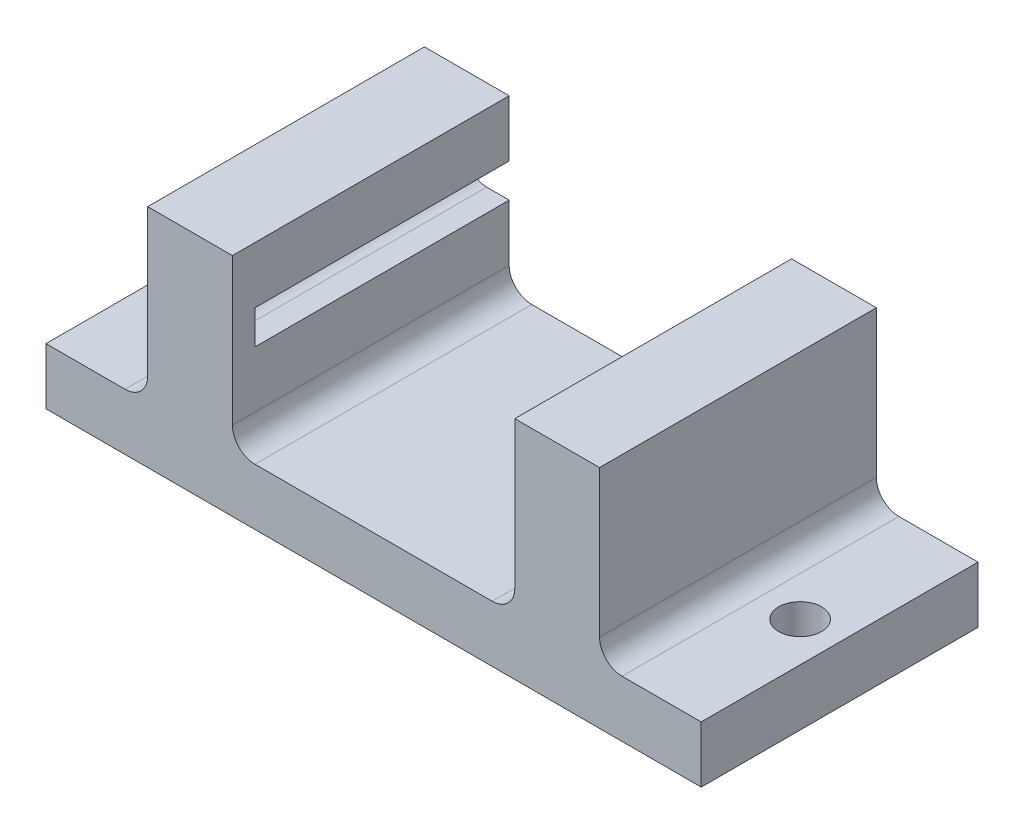
ISO-10303-21;
HEADER;
FILE_DESCRIPTION(('STEP AP214'),'2;1');
FILE_NAME('part.step','',(''),(''),'','','');
FILE_SCHEMA(('AUTOMOTIVE_DESIGN { 1 0 10303 214 1 1 1 1 }'));
ENDSEC;
DATA;
#1=APPLICATION_CONTEXT('core data for automotive mechanical design processes');
#2=APPLICATION_PROTOCOL_DEFINITION('international standard','automotive_design',2000,#1);
#3=PRODUCT_CONTEXT('',#1,'mechanical');
#4=PRODUCT('Part','Part','',(#3));
#5=PRODUCT_RELATED_PRODUCT_CATEGORY('part','',(#4));
#6=PRODUCT_DEFINITION_FORMATION('','',#4);
#7=PRODUCT_DEFINITION_CONTEXT('part definition',#1,'design');
#8=PRODUCT_DEFINITION('design','',#6,#7);
#9=PRODUCT_DEFINITION_SHAPE('','',#8);
#10=(LENGTH_UNIT() NAMED_UNIT(*) SI_UNIT(.MILLI.,.METRE.));
#11=(NAMED_UNIT(*) PLANE_ANGLE_UNIT() SI_UNIT($,.RADIAN.));
#12=(NAMED_UNIT(*) SI_UNIT($,.STERADIAN.) SOLID_ANGLE_UNIT());
#13=UNCERTAINTY_MEASURE_WITH_UNIT(LENGTH_MEASURE(1.E-05),#10,'distance_accuracy_value','');
#14=(GEOMETRIC_REPRESENTATION_CONTEXT(3) GLOBAL_UNCERTAINTY_ASSIGNED_CONTEXT((#13)) GLOBAL_UNIT_ASSIGNED_CONTEXT((#10,
#11,#12)) REPRESENTATION_CONTEXT('',''));
#15=CARTESIAN_POINT('',(0.,0.,0.));
#16=DIRECTION('',(0.,0.,1.));
#17=DIRECTION('',(1.,0.,0.));
#18=AXIS2_PLACEMENT_3D('',#15,#16,#17);
#19=CARTESIAN_POINT('',(0.,-25.4,28.575));
#20=DIRECTION('',(0.,1.,0.));
#21=DIRECTION('',(0.,0.,1.));
#22=AXIS2_PLACEMENT_3D('',#19,#20,#21);
#23=PLANE('',#22);
#24=CARTESIAN_POINT('',(-32.385,-25.4,15.5575));
#25=DIRECTION('',(0.,-1.,0.));
#26=DIRECTION('',(0.,0.,1.));
#27=AXIS2_PLACEMENT_3D('',#24,#25,#26);
#28=CIRCLE('',#27,2.41299999999999);
#29=CARTESIAN_POINT('',(-32.385,-25.4,17.9705));
#30=VERTEX_POINT('',#29);
#31=EDGE_CURVE('E236',#30,#30,#28,.T.);
#32=ORIENTED_EDGE('',*,*,#31,.F.);
#33=EDGE_LOOP('',(#32));
#34=FACE_BOUND('',#33,.T.);
#35=CARTESIAN_POINT('',(32.385,-25.4,15.5575));
#36=DIRECTION('',(0.,1.,0.));
#37=DIRECTION('',(0.,0.,1.));
#38=AXIS2_PLACEMENT_3D('',#35,#36,#37);
#39=CIRCLE('',#38,2.41299999999999);
#40=CARTESIAN_POINT('',(32.385,-25.4,17.9705));
#41=VERTEX_POINT('',#40);
#42=EDGE_CURVE('E319',#41,#41,#39,.T.);
#43=ORIENTED_EDGE('',*,*,#42,.T.);
#44=EDGE_LOOP('',(#43));
#45=FACE_BOUND('',#44,.T.);
#46=DIRECTION('',(1.,0.,0.));
#47=VECTOR('',#46,1.);
#48=CARTESIAN_POINT('',(0.,-25.4,0.));
#49=LINE('',#48,#47);
#50=CARTESIAN_POINT('',(-36.83,-25.4,0.));
#51=VERTEX_POINT('',#50);
#52=CARTESIAN_POINT('',(36.83,-25.4,0.));
#53=VERTEX_POINT('',#52);
#54=EDGE_CURVE('E217',#51,#53,#49,.T.);
#55=ORIENTED_EDGE('',*,*,#54,.T.);
#56=DIRECTION('',(0.,0.,-1.));
#57=VECTOR('',#56,1.);
#58=CARTESIAN_POINT('',(36.83,-25.4,28.575));
#59=LINE('',#58,#57);
#60=CARTESIAN_POINT('',(36.83,-25.4,31.115));
#61=VERTEX_POINT('',#60);
#62=EDGE_CURVE('E11',#61,#53,#59,.T.);
#63=ORIENTED_EDGE('',*,*,#62,.F.);
#64=DIRECTION('',(1.,0.,0.));
#65=VECTOR('',#64,1.);
#66=CARTESIAN_POINT('',(0.,-25.4,31.115));
#67=LINE('',#66,#65);
#68=CARTESIAN_POINT('',(-36.83,-25.4,31.115));
#69=VERTEX_POINT('',#68);
#70=EDGE_CURVE('E325',#69,#61,#67,.T.);
#71=ORIENTED_EDGE('',*,*,#70,.F.);
#72=DIRECTION('',(0.,0.,-1.));
#73=VECTOR('',#72,1.);
#74=CARTESIAN_POINT('',(-36.83,-25.4,28.575));
#75=LINE('',#74,#73);
#76=EDGE_CURVE('E267',#69,#51,#75,.T.);
#77=ORIENTED_EDGE('',*,*,#76,.T.);
#78=EDGE_LOOP('',(#55,#63,#71,#77));
#79=FACE_BOUND('',#78,.T.);
#80=ADVANCED_FACE('F33',(#34,#45,#79),#23,.F.);
#81=CARTESIAN_POINT('',(36.83,-25.4,28.575));
#82=DIRECTION('',(-1.,0.,0.));
#83=DIRECTION('',(0.,0.,1.));
#84=AXIS2_PLACEMENT_3D('',#81,#82,#83);
#85=PLANE('',#84);
#86=DIRECTION('',(0.,1.,0.));
#87=VECTOR('',#86,1.);
#88=CARTESIAN_POINT('',(36.83,-25.4,0.));
#89=LINE('',#88,#87);
#90=CARTESIAN_POINT('',(36.83,-19.05,0.));
#91=VERTEX_POINT('',#90);
#92=EDGE_CURVE('E416',#53,#91,#89,.T.);
#93=ORIENTED_EDGE('',*,*,#92,.T.);
#94=DIRECTION('',(0.,0.,-1.));
#95=VECTOR('',#94,1.);
#96=CARTESIAN_POINT('',(36.83,-19.05,28.575));
#97=LINE('',#96,#95);
#98=CARTESIAN_POINT('',(36.83,-19.05,31.115));
#99=VERTEX_POINT('',#98);
#100=EDGE_CURVE('E42',#99,#91,#97,.T.);
#101=ORIENTED_EDGE('',*,*,#100,.F.);
#102=DIRECTION('',(0.,1.,0.));
#103=VECTOR('',#102,1.);
#104=CARTESIAN_POINT('',(36.83,-25.4,31.115));
#105=LINE('',#104,#103);
#106=EDGE_CURVE('E328',#61,#99,#105,.T.);
#107=ORIENTED_EDGE('',*,*,#106,.F.);
#108=ORIENTED_EDGE('',*,*,#62,.T.);
#109=EDGE_LOOP('',(#93,#101,#107,#108));
#110=FACE_BOUND('',#109,.T.);
#111=ADVANCED_FACE('F423',(#110),#85,.F.);
#112=CARTESIAN_POINT('',(36.83,-19.05,28.575));
#113=DIRECTION('',(0.,-1.,0.));
#114=DIRECTION('',(0.,0.,-1.));
#115=AXIS2_PLACEMENT_3D('',#112,#113,#114);
#116=PLANE('',#115);
#117=CARTESIAN_POINT('',(32.385,-19.05,15.5575));
#118=DIRECTION('',(0.,1.,0.));
#119=DIRECTION('',(0.,0.,1.));
#120=AXIS2_PLACEMENT_3D('',#117,#118,#119);
#121=CIRCLE('',#120,2.41299999999999);
#122=CARTESIAN_POINT('',(32.385,-19.05,17.9705));
#123=VERTEX_POINT('',#122);
#124=EDGE_CURVE('E227',#123,#123,#121,.T.);
#125=ORIENTED_EDGE('',*,*,#124,.F.);
#126=EDGE_LOOP('',(#125));
#127=FACE_BOUND('',#126,.T.);
#128=DIRECTION('',(-1.,0.,0.));
#129=VECTOR('',#128,1.);
#130=CARTESIAN_POINT('',(36.83,-19.05,0.));
#131=LINE('',#130,#129);
#132=CARTESIAN_POINT('',(27.94,-19.05,0.));
#133=VERTEX_POINT('',#132);
#134=EDGE_CURVE('E415',#91,#133,#131,.T.);
#135=ORIENTED_EDGE('',*,*,#134,.T.);
#136=DIRECTION('',(0.,0.,-1.));
#137=VECTOR('',#136,1.);
#138=CARTESIAN_POINT('',(27.94,-19.05,28.575));
#139=LINE('',#138,#137);
#140=CARTESIAN_POINT('',(27.94,-19.05,31.115));
#141=VERTEX_POINT('',#140);
#142=EDGE_CURVE('E390',#141,#133,#139,.T.);
#143=ORIENTED_EDGE('',*,*,#142,.F.);
#144=DIRECTION('',(-1.,0.,0.));
#145=VECTOR('',#144,1.);
#146=CARTESIAN_POINT('',(36.83,-19.05,31.115));
#147=LINE('',#146,#145);
#148=EDGE_CURVE('E331',#99,#141,#147,.T.);
#149=ORIENTED_EDGE('',*,*,#148,.F.);
#150=ORIENTED_EDGE('',*,*,#100,.T.);
#151=EDGE_LOOP('',(#135,#143,#149,#150));
#152=FACE_BOUND('',#151,.T.);
#153=ADVANCED_FACE('F428',(#127,#152),#116,.F.);
#154=CARTESIAN_POINT('',(27.94,-16.51,28.575));
#155=DIRECTION('',(0.,0.,-1.));
#156=DIRECTION('',(-1.,0.,0.));
#157=AXIS2_PLACEMENT_3D('',#154,#155,#156);
#158=CYLINDRICAL_SURFACE('',#157,2.54);
#159=CARTESIAN_POINT('',(27.94,-16.51,0.));
#160=DIRECTION('',(0.,0.,-1.));
#161=DIRECTION('',(1.,0.,0.));
#162=AXIS2_PLACEMENT_3D('',#159,#160,#161);
#163=CIRCLE('',#162,2.54);
#164=CARTESIAN_POINT('',(25.4,-16.51,0.));
#165=VERTEX_POINT('',#164);
#166=EDGE_CURVE('E413',#133,#165,#163,.T.);
#167=ORIENTED_EDGE('',*,*,#166,.T.);
#168=DIRECTION('',(0.,0.,-1.));
#169=VECTOR('',#168,1.);
#170=CARTESIAN_POINT('',(25.4,-16.51,28.575));
#171=LINE('',#170,#169);
#172=CARTESIAN_POINT('',(25.4,-16.51,31.115));
#173=VERTEX_POINT('',#172);
#174=EDGE_CURVE('E387',#173,#165,#171,.T.);
#175=ORIENTED_EDGE('',*,*,#174,.F.);
#176=CARTESIAN_POINT('',(27.94,-16.51,31.115));
#177=DIRECTION('',(0.,0.,-1.));
#178=DIRECTION('',(1.,0.,0.));
#179=AXIS2_PLACEMENT_3D('',#176,#177,#178);
#180=CIRCLE('',#179,2.54);
#181=EDGE_CURVE('E334',#141,#173,#180,.T.);
#182=ORIENTED_EDGE('',*,*,#181,.F.);
#183=ORIENTED_EDGE('',*,*,#142,.T.);
#184=EDGE_LOOP('',(#167,#175,#182,#183));
#185=FACE_BOUND('',#184,.T.);
#186=ADVANCED_FACE('F432',(#185),#158,.F.);
#187=CARTESIAN_POINT('',(25.4,-16.51,28.575));
#188=DIRECTION('',(-1.,0.,0.));
#189=DIRECTION('',(0.,-1.,0.));
#190=AXIS2_PLACEMENT_3D('',#187,#188,#189);
#191=PLANE('',#190);
#192=DIRECTION('',(0.,1.,0.));
#193=VECTOR('',#192,1.);
#194=CARTESIAN_POINT('',(25.4,-16.51,0.));
#195=LINE('',#194,#193);
#196=CARTESIAN_POINT('',(25.4,0.,0.));
#197=VERTEX_POINT('',#196);
#198=EDGE_CURVE('E411',#165,#197,#195,.T.);
#199=ORIENTED_EDGE('',*,*,#198,.T.);
#200=DIRECTION('',(0.,0.,-1.));
#201=VECTOR('',#200,1.);
#202=CARTESIAN_POINT('',(25.4,0.,28.575));
#203=LINE('',#202,#201);
#204=CARTESIAN_POINT('',(25.4,0.,31.115));
#205=VERTEX_POINT('',#204);
#206=EDGE_CURVE('E384',#205,#197,#203,.T.);
#207=ORIENTED_EDGE('',*,*,#206,.F.);
#208=DIRECTION('',(0.,1.,0.));
#209=VECTOR('',#208,1.);
#210=CARTESIAN_POINT('',(25.4,-16.51,31.115));
#211=LINE('',#210,#209);
#212=EDGE_CURVE('E337',#173,#205,#211,.T.);
#213=ORIENTED_EDGE('',*,*,#212,.F.);
#214=ORIENTED_EDGE('',*,*,#174,.T.);
#215=EDGE_LOOP('',(#199,#207,#213,#214));
#216=FACE_BOUND('',#215,.T.);
#217=ADVANCED_FACE('F436',(#216),#191,.F.);
#218=CARTESIAN_POINT('',(25.4,0.,28.575));
#219=DIRECTION('',(0.,-1.,0.));
#220=DIRECTION('',(1.,0.,0.));
#221=AXIS2_PLACEMENT_3D('',#218,#219,#220);
#222=PLANE('',#221);
#223=DIRECTION('',(-1.,0.,0.));
#224=VECTOR('',#223,1.);
#225=CARTESIAN_POINT('',(25.4,0.,0.));
#226=LINE('',#225,#224);
#227=CARTESIAN_POINT('',(15.875,0.,0.));
#228=VERTEX_POINT('',#227);
#229=EDGE_CURVE('E409',#197,#228,#226,.T.);
#230=ORIENTED_EDGE('',*,*,#229,.T.);
#231=DIRECTION('',(0.,0.,-1.));
#232=VECTOR('',#231,1.);
#233=CARTESIAN_POINT('',(15.875,0.,28.575));
#234=LINE('',#233,#232);
#235=CARTESIAN_POINT('',(15.875,0.,31.115));
#236=VERTEX_POINT('',#235);
#237=EDGE_CURVE('E365',#236,#228,#234,.T.);
#238=ORIENTED_EDGE('',*,*,#237,.F.);
#239=DIRECTION('',(-1.,0.,0.));
#240=VECTOR('',#239,1.);
#241=CARTESIAN_POINT('',(25.4,0.,31.115));
#242=LINE('',#241,#240);
#243=EDGE_CURVE('E340',#205,#236,#242,.T.);
#244=ORIENTED_EDGE('',*,*,#243,.F.);
#245=ORIENTED_EDGE('',*,*,#206,.T.);
#246=EDGE_LOOP('',(#230,#238,#244,#245));
#247=FACE_BOUND('',#246,.T.);
#248=ADVANCED_FACE('F439',(#247),#222,.F.);
#249=CARTESIAN_POINT('',(15.875,-6.35,28.575));
#250=DIRECTION('',(0.,1.,0.));
#251=DIRECTION('',(-1.,0.,0.));
#252=AXIS2_PLACEMENT_3D('',#249,#250,#251);
#253=PLANE('',#252);
#254=DIRECTION('',(1.,0.,0.));
#255=VECTOR('',#254,1.);
#256=CARTESIAN_POINT('',(15.875,-6.35,0.));
#257=LINE('',#256,#255);
#258=CARTESIAN_POINT('',(15.875,-6.35,0.));
#259=VERTEX_POINT('',#258);
#260=CARTESIAN_POINT('',(18.415,-6.35,0.));
#261=VERTEX_POINT('',#260);
#262=EDGE_CURVE('E405',#259,#261,#257,.T.);
#263=ORIENTED_EDGE('',*,*,#262,.T.);
#264=DIRECTION('',(0.,0.,-1.));
#265=VECTOR('',#264,1.);
#266=CARTESIAN_POINT('',(18.415,-6.35,28.575));
#267=LINE('',#266,#265);
#268=CARTESIAN_POINT('',(18.415,-6.35,28.575));
#269=VERTEX_POINT('',#268);
#270=EDGE_CURVE('E366',#269,#261,#267,.T.);
#271=ORIENTED_EDGE('',*,*,#270,.F.);
#272=DIRECTION('',(1.,0.,0.));
#273=VECTOR('',#272,1.);
#274=CARTESIAN_POINT('',(15.875,-6.35,28.575));
#275=LINE('',#274,#273);
#276=CARTESIAN_POINT('',(15.875,-6.35,28.575));
#277=VERTEX_POINT('',#276);
#278=EDGE_CURVE('E353',#277,#269,#275,.T.);
#279=ORIENTED_EDGE('',*,*,#278,.F.);
#280=DIRECTION('',(0.,0.,-1.));
#281=VECTOR('',#280,1.);
#282=CARTESIAN_POINT('',(15.875,-6.35,28.575));
#283=LINE('',#282,#281);
#284=EDGE_CURVE('E104',#277,#259,#283,.T.);
#285=ORIENTED_EDGE('',*,*,#284,.T.);
#286=EDGE_LOOP('',(#263,#271,#279,#285));
#287=FACE_BOUND('',#286,.T.);
#288=ADVANCED_FACE('F444',(#287),#253,.F.);
#289=CARTESIAN_POINT('',(18.415,-8.255,28.575));
#290=DIRECTION('',(0.,0.,-1.));
#291=DIRECTION('',(-1.,0.,0.));
#292=AXIS2_PLACEMENT_3D('',#289,#290,#291);
#293=CYLINDRICAL_SURFACE('',#292,1.905);
#294=CARTESIAN_POINT('',(18.415,-8.255,0.));
#295=DIRECTION('',(0.,0.,-1.));
#296=DIRECTION('',(1.,0.,0.));
#297=AXIS2_PLACEMENT_3D('',#294,#295,#296);
#298=CIRCLE('',#297,1.905);
#299=CARTESIAN_POINT('',(18.415,-10.16,0.));
#300=VERTEX_POINT('',#299);
#301=EDGE_CURVE('E401',#261,#300,#298,.T.);
#302=ORIENTED_EDGE('',*,*,#301,.T.);
#303=DIRECTION('',(0.,0.,-1.));
#304=VECTOR('',#303,1.);
#305=CARTESIAN_POINT('',(18.415,-10.16,28.575));
#306=LINE('',#305,#304);
#307=CARTESIAN_POINT('',(18.415,-10.16,28.575));
#308=VERTEX_POINT('',#307);
#309=EDGE_CURVE('E51',#308,#300,#306,.T.);
#310=ORIENTED_EDGE('',*,*,#309,.F.);
#311=CARTESIAN_POINT('',(18.415,-8.255,28.575));
#312=DIRECTION('',(0.,0.,-1.));
#313=DIRECTION('',(1.,0.,0.));
#314=AXIS2_PLACEMENT_3D('',#311,#312,#313);
#315=CIRCLE('',#314,1.905);
#316=EDGE_CURVE('E349',#269,#308,#315,.T.);
#317=ORIENTED_EDGE('',*,*,#316,.F.);
#318=ORIENTED_EDGE('',*,*,#270,.T.);
#319=EDGE_LOOP('',(#302,#310,#317,#318));
#320=FACE_BOUND('',#319,.T.);
#321=ADVANCED_FACE('F448',(#320),#293,.F.);
#322=CARTESIAN_POINT('',(15.875,-10.16,28.575));
#323=DIRECTION('',(0.,-1.,0.));
#324=DIRECTION('',(1.,0.,0.));
#325=AXIS2_PLACEMENT_3D('',#322,#323,#324);
#326=PLANE('',#325);
#327=DIRECTION('',(-1.,0.,0.));
#328=VECTOR('',#327,1.);
#329=CARTESIAN_POINT('',(15.875,-10.16,0.));
#330=LINE('',#329,#328);
#331=CARTESIAN_POINT('',(15.875,-10.16,0.));
#332=VERTEX_POINT('',#331);
#333=EDGE_CURVE('E400',#300,#332,#330,.T.);
#334=ORIENTED_EDGE('',*,*,#333,.T.);
#335=DIRECTION('',(0.,0.,-1.));
#336=VECTOR('',#335,1.);
#337=CARTESIAN_POINT('',(15.875,-10.16,28.575));
#338=LINE('',#337,#336);
#339=CARTESIAN_POINT('',(15.875,-10.16,28.575));
#340=VERTEX_POINT('',#339);
#341=EDGE_CURVE('E378',#340,#332,#338,.T.);
#342=ORIENTED_EDGE('',*,*,#341,.F.);
#343=DIRECTION('',(-1.,0.,0.));
#344=VECTOR('',#343,1.);
#345=CARTESIAN_POINT('',(15.875,-10.16,28.575));
#346=LINE('',#345,#344);
#347=EDGE_CURVE('E352',#308,#340,#346,.T.);
#348=ORIENTED_EDGE('',*,*,#347,.F.);
#349=ORIENTED_EDGE('',*,*,#309,.T.);
#350=EDGE_LOOP('',(#334,#342,#348,#349));
#351=FACE_BOUND('',#350,.T.);
#352=ADVANCED_FACE('F446',(#351),#326,.F.);
#353=CARTESIAN_POINT('',(15.875,-16.51,28.575));
#354=DIRECTION('',(1.,0.,0.));
#355=DIRECTION('',(0.,1.,0.));
#356=AXIS2_PLACEMENT_3D('',#353,#354,#355);
#357=PLANE('',#356);
#358=DIRECTION('',(0.,-1.,0.));
#359=VECTOR('',#358,1.);
#360=CARTESIAN_POINT('',(15.875,-16.51,0.));
#361=LINE('',#360,#359);
#362=CARTESIAN_POINT('',(15.875,-16.51,0.));
#363=VERTEX_POINT('',#362);
#364=EDGE_CURVE('E93',#332,#363,#361,.T.);
#365=ORIENTED_EDGE('',*,*,#364,.T.);
#366=DIRECTION('',(0.,0.,-1.));
#367=VECTOR('',#366,1.);
#368=CARTESIAN_POINT('',(15.875,-16.51,28.575));
#369=LINE('',#368,#367);
#370=CARTESIAN_POINT('',(15.875,-16.51,31.115));
#371=VERTEX_POINT('',#370);
#372=EDGE_CURVE('E376',#371,#363,#369,.T.);
#373=ORIENTED_EDGE('',*,*,#372,.F.);
#374=DIRECTION('',(0.,-1.,0.));
#375=VECTOR('',#374,1.);
#376=CARTESIAN_POINT('',(15.875,0.,31.115));
#377=LINE('',#376,#375);
#378=EDGE_CURVE('E343',#236,#371,#377,.T.);
#379=ORIENTED_EDGE('',*,*,#378,.F.);
#380=ORIENTED_EDGE('',*,*,#237,.T.);
#381=DIRECTION('',(0.,-1.,0.));
#382=VECTOR('',#381,1.);
#383=CARTESIAN_POINT('',(15.875,0.,0.));
#384=LINE('',#383,#382);
#385=EDGE_CURVE('E407',#228,#259,#384,.T.);
#386=ORIENTED_EDGE('',*,*,#385,.T.);
#387=ORIENTED_EDGE('',*,*,#284,.F.);
#388=DIRECTION('',(0.,-1.,0.));
#389=VECTOR('',#388,1.);
#390=CARTESIAN_POINT('',(15.875,-10.16,28.575));
#391=LINE('',#390,#389);
#392=EDGE_CURVE('E322',#277,#340,#391,.T.);
#393=ORIENTED_EDGE('',*,*,#392,.T.);
#394=ORIENTED_EDGE('',*,*,#341,.T.);
#395=EDGE_LOOP('',(#365,#373,#379,#380,#386,#387,#393,#394));
#396=FACE_BOUND('',#395,.T.);
#397=ADVANCED_FACE('F394',(#396),#357,.F.);
#398=CARTESIAN_POINT('',(13.335,-16.51,28.575));
#399=DIRECTION('',(0.,0.,-1.));
#400=DIRECTION('',(-1.,0.,0.));
#401=AXIS2_PLACEMENT_3D('',#398,#399,#400);
#402=CYLINDRICAL_SURFACE('',#401,2.54);
#403=CARTESIAN_POINT('',(13.335,-16.51,0.));
#404=DIRECTION('',(0.,0.,-1.));
#405=DIRECTION('',(1.,0.,0.));
#406=AXIS2_PLACEMENT_3D('',#403,#404,#405);
#407=CIRCLE('',#406,2.54);
#408=CARTESIAN_POINT('',(13.335,-19.05,0.));
#409=VERTEX_POINT('',#408);
#410=EDGE_CURVE('E99',#363,#409,#407,.T.);
#411=ORIENTED_EDGE('',*,*,#410,.T.);
#412=DIRECTION('',(0.,0.,-1.));
#413=VECTOR('',#412,1.);
#414=CARTESIAN_POINT('',(13.335,-19.05,28.575));
#415=LINE('',#414,#413);
#416=CARTESIAN_POINT('',(13.335,-19.05,31.115));
#417=VERTEX_POINT('',#416);
#418=EDGE_CURVE('E361',#417,#409,#415,.T.);
#419=ORIENTED_EDGE('',*,*,#418,.F.);
#420=CARTESIAN_POINT('',(13.335,-16.51,31.115));
#421=DIRECTION('',(0.,0.,-1.));
#422=DIRECTION('',(1.,0.,0.));
#423=AXIS2_PLACEMENT_3D('',#420,#421,#422);
#424=CIRCLE('',#423,2.54);
#425=EDGE_CURVE('E215',#371,#417,#424,.T.);
#426=ORIENTED_EDGE('',*,*,#425,.F.);
#427=ORIENTED_EDGE('',*,*,#372,.T.);
#428=EDGE_LOOP('',(#411,#419,#426,#427));
#429=FACE_BOUND('',#428,.T.);
#430=ADVANCED_FACE('F454',(#429),#402,.F.);
#431=CARTESIAN_POINT('',(13.335,-19.05,28.575));
#432=DIRECTION('',(0.,-1.,0.));
#433=DIRECTION('',(1.,0.,0.));
#434=AXIS2_PLACEMENT_3D('',#431,#432,#433);
#435=PLANE('',#434);
#436=DIRECTION('',(-1.,0.,0.));
#437=VECTOR('',#436,1.);
#438=CARTESIAN_POINT('',(13.335,-19.05,0.));
#439=LINE('',#438,#437);
#440=CARTESIAN_POINT('',(-13.335,-19.05,0.));
#441=VERTEX_POINT('',#440);
#442=EDGE_CURVE('E223',#409,#441,#439,.T.);
#443=ORIENTED_EDGE('',*,*,#442,.T.);
#444=DIRECTION('',(0.,0.,-1.));
#445=VECTOR('',#444,1.);
#446=CARTESIAN_POINT('',(-13.335,-19.05,28.575));
#447=LINE('',#446,#445);
#448=CARTESIAN_POINT('',(-13.335,-19.05,31.115));
#449=VERTEX_POINT('',#448);
#450=EDGE_CURVE('E220',#449,#441,#447,.T.);
#451=ORIENTED_EDGE('',*,*,#450,.F.);
#452=DIRECTION('',(-1.,0.,0.));
#453=VECTOR('',#452,1.);
#454=CARTESIAN_POINT('',(13.335,-19.05,31.115));
#455=LINE('',#454,#453);
#456=EDGE_CURVE('E206',#417,#449,#455,.T.);
#457=ORIENTED_EDGE('',*,*,#456,.F.);
#458=ORIENTED_EDGE('',*,*,#418,.T.);
#459=EDGE_LOOP('',(#443,#451,#457,#458));
#460=FACE_BOUND('',#459,.T.);
#461=ADVANCED_FACE('F221',(#460),#435,.F.);
#462=CARTESIAN_POINT('',(27.94,-16.51,0.));
#463=DIRECTION('',(0.,0.,1.));
#464=DIRECTION('',(1.,0.,0.));
#465=AXIS2_PLACEMENT_3D('',#462,#463,#464);
#466=PLANE('',#465);
#467=ORIENTED_EDGE('',*,*,#54,.F.);
#468=DIRECTION('',(0.,1.,0.));
#469=VECTOR('',#468,1.);
#470=CARTESIAN_POINT('',(-36.83,-25.4,0.));
#471=LINE('',#470,#469);
#472=CARTESIAN_POINT('',(-36.83,-19.05,0.));
#473=VERTEX_POINT('',#472);
#474=EDGE_CURVE('E261',#51,#473,#471,.T.);
#475=ORIENTED_EDGE('',*,*,#474,.T.);
#476=DIRECTION('',(1.,0.,0.));
#477=VECTOR('',#476,1.);
#478=CARTESIAN_POINT('',(-36.83,-19.05,0.));
#479=LINE('',#478,#477);
#480=CARTESIAN_POINT('',(-27.94,-19.05,0.));
#481=VERTEX_POINT('',#480);
#482=EDGE_CURVE('E293',#473,#481,#479,.T.);
#483=ORIENTED_EDGE('',*,*,#482,.T.);
#484=CARTESIAN_POINT('',(-27.94,-16.51,0.));
#485=DIRECTION('',(0.,0.,1.));
#486=DIRECTION('',(-1.,0.,0.));
#487=AXIS2_PLACEMENT_3D('',#484,#485,#486);
#488=CIRCLE('',#487,2.54);
#489=CARTESIAN_POINT('',(-25.4,-16.51,0.));
#490=VERTEX_POINT('',#489);
#491=EDGE_CURVE('E290',#481,#490,#488,.T.);
#492=ORIENTED_EDGE('',*,*,#491,.T.);
#493=DIRECTION('',(0.,1.,0.));
#494=VECTOR('',#493,1.);
#495=CARTESIAN_POINT('',(-25.4,-16.51,0.));
#496=LINE('',#495,#494);
#497=CARTESIAN_POINT('',(-25.4,0.,0.));
#498=VERTEX_POINT('',#497);
#499=EDGE_CURVE('E287',#490,#498,#496,.T.);
#500=ORIENTED_EDGE('',*,*,#499,.T.);
#501=DIRECTION('',(1.,0.,0.));
#502=VECTOR('',#501,1.);
#503=CARTESIAN_POINT('',(-25.4,0.,0.));
#504=LINE('',#503,#502);
#505=CARTESIAN_POINT('',(-15.875,0.,0.));
#506=VERTEX_POINT('',#505);
#507=EDGE_CURVE('E284',#498,#506,#504,.T.);
#508=ORIENTED_EDGE('',*,*,#507,.T.);
#509=DIRECTION('',(0.,-1.,0.));
#510=VECTOR('',#509,1.);
#511=CARTESIAN_POINT('',(-15.875,0.,0.));
#512=LINE('',#511,#510);
#513=CARTESIAN_POINT('',(-15.875,-6.35,0.));
#514=VERTEX_POINT('',#513);
#515=EDGE_CURVE('E281',#506,#514,#512,.T.);
#516=ORIENTED_EDGE('',*,*,#515,.T.);
#517=DIRECTION('',(-1.,0.,0.));
#518=VECTOR('',#517,1.);
#519=CARTESIAN_POINT('',(-15.875,-6.35,0.));
#520=LINE('',#519,#518);
#521=CARTESIAN_POINT('',(-18.415,-6.35,0.));
#522=VERTEX_POINT('',#521);
#523=EDGE_CURVE('E278',#514,#522,#520,.T.);
#524=ORIENTED_EDGE('',*,*,#523,.T.);
#525=CARTESIAN_POINT('',(-18.415,-8.255,0.));
#526=DIRECTION('',(0.,0.,1.));
#527=DIRECTION('',(-1.,0.,0.));
#528=AXIS2_PLACEMENT_3D('',#525,#526,#527);
#529=CIRCLE('',#528,1.905);
#530=CARTESIAN_POINT('',(-18.415,-10.16,0.));
#531=VERTEX_POINT('',#530);
#532=EDGE_CURVE('E275',#522,#531,#529,.T.);
#533=ORIENTED_EDGE('',*,*,#532,.T.);
#534=DIRECTION('',(1.,0.,0.));
#535=VECTOR('',#534,1.);
#536=CARTESIAN_POINT('',(-15.875,-10.16,0.));
#537=LINE('',#536,#535);
#538=CARTESIAN_POINT('',(-15.875,-10.16,0.));
#539=VERTEX_POINT('',#538);
#540=EDGE_CURVE('E272',#531,#539,#537,.T.);
#541=ORIENTED_EDGE('',*,*,#540,.T.);
#542=DIRECTION('',(0.,-1.,0.));
#543=VECTOR('',#542,1.);
#544=CARTESIAN_POINT('',(-15.875,-16.51,0.));
#545=LINE('',#544,#543);
#546=CARTESIAN_POINT('',(-15.875,-16.51,0.));
#547=VERTEX_POINT('',#546);
#548=EDGE_CURVE('E269',#539,#547,#545,.T.);
#549=ORIENTED_EDGE('',*,*,#548,.T.);
#550=CARTESIAN_POINT('',(-13.335,-16.51,0.));
#551=DIRECTION('',(0.,0.,1.));
#552=DIRECTION('',(-1.,0.,0.));
#553=AXIS2_PLACEMENT_3D('',#550,#551,#552);
#554=CIRCLE('',#553,2.54);
#555=EDGE_CURVE('E255',#547,#441,#554,.T.);
#556=ORIENTED_EDGE('',*,*,#555,.T.);
#557=ORIENTED_EDGE('',*,*,#442,.F.);
#558=ORIENTED_EDGE('',*,*,#410,.F.);
#559=ORIENTED_EDGE('',*,*,#364,.F.);
#560=ORIENTED_EDGE('',*,*,#333,.F.);
#561=ORIENTED_EDGE('',*,*,#301,.F.);
#562=ORIENTED_EDGE('',*,*,#262,.F.);
#563=ORIENTED_EDGE('',*,*,#385,.F.);
#564=ORIENTED_EDGE('',*,*,#229,.F.);
#565=ORIENTED_EDGE('',*,*,#198,.F.);
#566=ORIENTED_EDGE('',*,*,#166,.F.);
#567=ORIENTED_EDGE('',*,*,#134,.F.);
#568=ORIENTED_EDGE('',*,*,#92,.F.);
#569=EDGE_LOOP('',(#467,#475,#483,#492,#500,#508,#516,#524,#533,#541,#549,#556,#557,#558,#559,
#560,#561,#562,#563,#564,#565,#566,#567,#568));
#570=FACE_BOUND('',#569,.T.);
#571=ADVANCED_FACE('F398',(#570),#466,.F.);
#572=CARTESIAN_POINT('',(27.94,-16.51,28.575));
#573=DIRECTION('',(0.,0.,1.));
#574=DIRECTION('',(1.,0.,0.));
#575=AXIS2_PLACEMENT_3D('',#572,#573,#574);
#576=PLANE('',#575);
#577=ORIENTED_EDGE('',*,*,#392,.F.);
#578=ORIENTED_EDGE('',*,*,#278,.T.);
#579=ORIENTED_EDGE('',*,*,#316,.T.);
#580=ORIENTED_EDGE('',*,*,#347,.T.);
#581=EDGE_LOOP('',(#577,#578,#579,#580));
#582=FACE_BOUND('',#581,.T.);
#583=ADVANCED_FACE('F445',(#582),#576,.F.);
#584=CARTESIAN_POINT('',(27.94,-16.51,31.115));
#585=DIRECTION('',(0.,0.,1.));
#586=DIRECTION('',(1.,0.,0.));
#587=AXIS2_PLACEMENT_3D('',#584,#585,#586);
#588=PLANE('',#587);
#589=ORIENTED_EDGE('',*,*,#456,.T.);
#590=CARTESIAN_POINT('',(-13.335,-16.51,31.115));
#591=DIRECTION('',(0.,0.,1.));
#592=DIRECTION('',(-1.,0.,0.));
#593=AXIS2_PLACEMENT_3D('',#590,#591,#592);
#594=CIRCLE('',#593,2.54);
#595=CARTESIAN_POINT('',(-15.875,-16.51,31.115));
#596=VERTEX_POINT('',#595);
#597=EDGE_CURVE('E211',#596,#449,#594,.T.);
#598=ORIENTED_EDGE('',*,*,#597,.F.);
#599=DIRECTION('',(0.,-1.,0.));
#600=VECTOR('',#599,1.);
#601=CARTESIAN_POINT('',(-15.875,-10.16,31.115));
#602=LINE('',#601,#600);
#603=CARTESIAN_POINT('',(-15.875,0.,31.115));
#604=VERTEX_POINT('',#603);
#605=EDGE_CURVE('E231',#604,#596,#602,.T.);
#606=ORIENTED_EDGE('',*,*,#605,.F.);
#607=DIRECTION('',(1.,0.,0.));
#608=VECTOR('',#607,1.);
#609=CARTESIAN_POINT('',(-25.4,0.,31.115));
#610=LINE('',#609,#608);
#611=CARTESIAN_POINT('',(-25.4,0.,31.115));
#612=VERTEX_POINT('',#611);
#613=EDGE_CURVE('E234',#612,#604,#610,.T.);
#614=ORIENTED_EDGE('',*,*,#613,.F.);
#615=DIRECTION('',(0.,1.,0.));
#616=VECTOR('',#615,1.);
#617=CARTESIAN_POINT('',(-25.4,-16.51,31.115));
#618=LINE('',#617,#616);
#619=CARTESIAN_POINT('',(-25.4,-16.51,31.115));
#620=VERTEX_POINT('',#619);
#621=EDGE_CURVE('E244',#620,#612,#618,.T.);
#622=ORIENTED_EDGE('',*,*,#621,.F.);
#623=CARTESIAN_POINT('',(-27.94,-16.51,31.115));
#624=DIRECTION('',(0.,0.,1.));
#625=DIRECTION('',(-1.,0.,0.));
#626=AXIS2_PLACEMENT_3D('',#623,#624,#625);
#627=CIRCLE('',#626,2.54);
#628=CARTESIAN_POINT('',(-27.94,-19.05,31.115));
#629=VERTEX_POINT('',#628);
#630=EDGE_CURVE('E247',#629,#620,#627,.T.);
#631=ORIENTED_EDGE('',*,*,#630,.F.);
#632=DIRECTION('',(1.,0.,0.));
#633=VECTOR('',#632,1.);
#634=CARTESIAN_POINT('',(-36.83,-19.05,31.115));
#635=LINE('',#634,#633);
#636=CARTESIAN_POINT('',(-36.83,-19.05,31.115));
#637=VERTEX_POINT('',#636);
#638=EDGE_CURVE('E250',#637,#629,#635,.T.);
#639=ORIENTED_EDGE('',*,*,#638,.F.);
#640=DIRECTION('',(0.,1.,0.));
#641=VECTOR('',#640,1.);
#642=CARTESIAN_POINT('',(-36.83,-25.4,31.115));
#643=LINE('',#642,#641);
#644=EDGE_CURVE('E253',#69,#637,#643,.T.);
#645=ORIENTED_EDGE('',*,*,#644,.F.);
#646=ORIENTED_EDGE('',*,*,#70,.T.);
#647=ORIENTED_EDGE('',*,*,#106,.T.);
#648=ORIENTED_EDGE('',*,*,#148,.T.);
#649=ORIENTED_EDGE('',*,*,#181,.T.);
#650=ORIENTED_EDGE('',*,*,#212,.T.);
#651=ORIENTED_EDGE('',*,*,#243,.T.);
#652=ORIENTED_EDGE('',*,*,#378,.T.);
#653=ORIENTED_EDGE('',*,*,#425,.T.);
#654=EDGE_LOOP('',(#589,#598,#606,#614,#622,#631,#639,#645,#646,#647,#648,#649,#650,#651,#652,#653));
#655=FACE_BOUND('',#654,.T.);
#656=ADVANCED_FACE('F208',(#655),#588,.T.);
#657=CARTESIAN_POINT('',(32.385,-25.4,15.5575));
#658=DIRECTION('',(0.,1.,0.));
#659=DIRECTION('',(0.,0.,1.));
#660=AXIS2_PLACEMENT_3D('',#657,#658,#659);
#661=CYLINDRICAL_SURFACE('',#660,2.41299999999999);
#662=ORIENTED_EDGE('',*,*,#42,.F.);
#663=EDGE_LOOP('',(#662));
#664=FACE_BOUND('',#663,.T.);
#665=ORIENTED_EDGE('',*,*,#124,.T.);
#666=EDGE_LOOP('',(#665));
#667=FACE_BOUND('',#666,.T.);
#668=ADVANCED_FACE('F467',(#664,#667),#661,.F.);
#669=CARTESIAN_POINT('',(-13.335,-16.51,28.575));
#670=DIRECTION('',(0.,0.,-1.));
#671=DIRECTION('',(-1.,0.,0.));
#672=AXIS2_PLACEMENT_3D('',#669,#670,#671);
#673=CYLINDRICAL_SURFACE('',#672,2.54);
#674=ORIENTED_EDGE('',*,*,#555,.F.);
#675=DIRECTION('',(0.,0.,-1.));
#676=VECTOR('',#675,1.);
#677=CARTESIAN_POINT('',(-15.875,-16.51,28.575));
#678=LINE('',#677,#676);
#679=EDGE_CURVE('E228',#596,#547,#678,.T.);
#680=ORIENTED_EDGE('',*,*,#679,.F.);
#681=ORIENTED_EDGE('',*,*,#597,.T.);
#682=ORIENTED_EDGE('',*,*,#450,.T.);
#683=EDGE_LOOP('',(#674,#680,#681,#682));
#684=FACE_BOUND('',#683,.T.);
#685=ADVANCED_FACE('F230',(#684),#673,.F.);
#686=CARTESIAN_POINT('',(-15.875,-16.51,28.575));
#687=DIRECTION('',(1.,0.,0.));
#688=DIRECTION('',(0.,1.,0.));
#689=AXIS2_PLACEMENT_3D('',#686,#687,#688);
#690=PLANE('',#689);
#691=ORIENTED_EDGE('',*,*,#548,.F.);
#692=DIRECTION('',(0.,0.,-1.));
#693=VECTOR('',#692,1.);
#694=CARTESIAN_POINT('',(-15.875,-10.16,28.575));
#695=LINE('',#694,#693);
#696=CARTESIAN_POINT('',(-15.875,-10.16,28.575));
#697=VERTEX_POINT('',#696);
#698=EDGE_CURVE('E316',#697,#539,#695,.T.);
#699=ORIENTED_EDGE('',*,*,#698,.F.);
#700=DIRECTION('',(0.,-1.,0.));
#701=VECTOR('',#700,1.);
#702=CARTESIAN_POINT('',(-15.875,0.,28.575));
#703=LINE('',#702,#701);
#704=CARTESIAN_POINT('',(-15.875,-6.35,28.575));
#705=VERTEX_POINT('',#704);
#706=EDGE_CURVE('E232',#705,#697,#703,.T.);
#707=ORIENTED_EDGE('',*,*,#706,.F.);
#708=DIRECTION('',(0.,0.,-1.));
#709=VECTOR('',#708,1.);
#710=CARTESIAN_POINT('',(-15.875,-6.35,28.575));
#711=LINE('',#710,#709);
#712=EDGE_CURVE('E310',#705,#514,#711,.T.);
#713=ORIENTED_EDGE('',*,*,#712,.T.);
#714=ORIENTED_EDGE('',*,*,#515,.F.);
#715=DIRECTION('',(0.,0.,-1.));
#716=VECTOR('',#715,1.);
#717=CARTESIAN_POINT('',(-15.875,0.,28.575));
#718=LINE('',#717,#716);
#719=EDGE_CURVE('E308',#604,#506,#718,.T.);
#720=ORIENTED_EDGE('',*,*,#719,.F.);
#721=ORIENTED_EDGE('',*,*,#605,.T.);
#722=ORIENTED_EDGE('',*,*,#679,.T.);
#723=EDGE_LOOP('',(#691,#699,#707,#713,#714,#720,#721,#722));
#724=FACE_BOUND('',#723,.T.);
#725=ADVANCED_FACE('F579',(#724),#690,.T.);
#726=CARTESIAN_POINT('',(-15.875,-10.16,28.575));
#727=DIRECTION('',(0.,1.,0.));
#728=DIRECTION('',(-1.,0.,0.));
#729=AXIS2_PLACEMENT_3D('',#726,#727,#728);
#730=PLANE('',#729);
#731=ORIENTED_EDGE('',*,*,#540,.F.);
#732=DIRECTION('',(0.,0.,-1.));
#733=VECTOR('',#732,1.);
#734=CARTESIAN_POINT('',(-18.415,-10.16,28.575));
#735=LINE('',#734,#733);
#736=CARTESIAN_POINT('',(-18.415,-10.16,28.575));
#737=VERTEX_POINT('',#736);
#738=EDGE_CURVE('E314',#737,#531,#735,.T.);
#739=ORIENTED_EDGE('',*,*,#738,.F.);
#740=DIRECTION('',(1.,0.,0.));
#741=VECTOR('',#740,1.);
#742=CARTESIAN_POINT('',(-15.875,-10.16,28.575));
#743=LINE('',#742,#741);
#744=EDGE_CURVE('E257',#737,#697,#743,.T.);
#745=ORIENTED_EDGE('',*,*,#744,.T.);
#746=ORIENTED_EDGE('',*,*,#698,.T.);
#747=EDGE_LOOP('',(#731,#739,#745,#746));
#748=FACE_BOUND('',#747,.T.);
#749=ADVANCED_FACE('F589',(#748),#730,.T.);
#750=CARTESIAN_POINT('',(-18.415,-8.255,28.575));
#751=DIRECTION('',(0.,0.,-1.));
#752=DIRECTION('',(-1.,0.,0.));
#753=AXIS2_PLACEMENT_3D('',#750,#751,#752);
#754=CYLINDRICAL_SURFACE('',#753,1.905);
#755=ORIENTED_EDGE('',*,*,#532,.F.);
#756=DIRECTION('',(0.,0.,-1.));
#757=VECTOR('',#756,1.);
#758=CARTESIAN_POINT('',(-18.415,-6.35,28.575));
#759=LINE('',#758,#757);
#760=CARTESIAN_POINT('',(-18.415,-6.35,28.575));
#761=VERTEX_POINT('',#760);
#762=EDGE_CURVE('E312',#761,#522,#759,.T.);
#763=ORIENTED_EDGE('',*,*,#762,.F.);
#764=CARTESIAN_POINT('',(-18.415,-8.255,28.575));
#765=DIRECTION('',(0.,0.,1.));
#766=DIRECTION('',(-1.,0.,0.));
#767=AXIS2_PLACEMENT_3D('',#764,#765,#766);
#768=CIRCLE('',#767,1.905);
#769=EDGE_CURVE('E260',#761,#737,#768,.T.);
#770=ORIENTED_EDGE('',*,*,#769,.T.);
#771=ORIENTED_EDGE('',*,*,#738,.T.);
#772=EDGE_LOOP('',(#755,#763,#770,#771));
#773=FACE_BOUND('',#772,.T.);
#774=ADVANCED_FACE('F601',(#773),#754,.F.);
#775=CARTESIAN_POINT('',(-15.875,-6.35,28.575));
#776=DIRECTION('',(0.,-1.,0.));
#777=DIRECTION('',(1.,0.,0.));
#778=AXIS2_PLACEMENT_3D('',#775,#776,#777);
#779=PLANE('',#778);
#780=ORIENTED_EDGE('',*,*,#523,.F.);
#781=ORIENTED_EDGE('',*,*,#712,.F.);
#782=DIRECTION('',(-1.,0.,0.));
#783=VECTOR('',#782,1.);
#784=CARTESIAN_POINT('',(-15.875,-6.35,28.575));
#785=LINE('',#784,#783);
#786=EDGE_CURVE('E264',#705,#761,#785,.T.);
#787=ORIENTED_EDGE('',*,*,#786,.T.);
#788=ORIENTED_EDGE('',*,*,#762,.T.);
#789=EDGE_LOOP('',(#780,#781,#787,#788));
#790=FACE_BOUND('',#789,.T.);
#791=ADVANCED_FACE('F612',(#790),#779,.T.);
#792=CARTESIAN_POINT('',(-25.4,0.,28.575));
#793=DIRECTION('',(0.,1.,0.));
#794=DIRECTION('',(-1.,0.,0.));
#795=AXIS2_PLACEMENT_3D('',#792,#793,#794);
#796=PLANE('',#795);
#797=ORIENTED_EDGE('',*,*,#507,.F.);
#798=DIRECTION('',(0.,0.,-1.));
#799=VECTOR('',#798,1.);
#800=CARTESIAN_POINT('',(-25.4,0.,28.575));
#801=LINE('',#800,#799);
#802=EDGE_CURVE('E306',#612,#498,#801,.T.);
#803=ORIENTED_EDGE('',*,*,#802,.F.);
#804=ORIENTED_EDGE('',*,*,#613,.T.);
#805=ORIENTED_EDGE('',*,*,#719,.T.);
#806=EDGE_LOOP('',(#797,#803,#804,#805));
#807=FACE_BOUND('',#806,.T.);
#808=ADVANCED_FACE('F622',(#807),#796,.T.);
#809=CARTESIAN_POINT('',(-25.4,-16.51,28.575));
#810=DIRECTION('',(-1.,0.,0.));
#811=DIRECTION('',(0.,-1.,0.));
#812=AXIS2_PLACEMENT_3D('',#809,#810,#811);
#813=PLANE('',#812);
#814=ORIENTED_EDGE('',*,*,#499,.F.);
#815=DIRECTION('',(0.,0.,-1.));
#816=VECTOR('',#815,1.);
#817=CARTESIAN_POINT('',(-25.4,-16.51,28.575));
#818=LINE('',#817,#816);
#819=EDGE_CURVE('E304',#620,#490,#818,.T.);
#820=ORIENTED_EDGE('',*,*,#819,.F.);
#821=ORIENTED_EDGE('',*,*,#621,.T.);
#822=ORIENTED_EDGE('',*,*,#802,.T.);
#823=EDGE_LOOP('',(#814,#820,#821,#822));
#824=FACE_BOUND('',#823,.T.);
#825=ADVANCED_FACE('F632',(#824),#813,.T.);
#826=CARTESIAN_POINT('',(-27.94,-16.51,28.575));
#827=DIRECTION('',(0.,0.,-1.));
#828=DIRECTION('',(-1.,0.,0.));
#829=AXIS2_PLACEMENT_3D('',#826,#827,#828);
#830=CYLINDRICAL_SURFACE('',#829,2.54);
#831=ORIENTED_EDGE('',*,*,#491,.F.);
#832=DIRECTION('',(0.,0.,-1.));
#833=VECTOR('',#832,1.);
#834=CARTESIAN_POINT('',(-27.94,-19.05,28.575));
#835=LINE('',#834,#833);
#836=EDGE_CURVE('E302',#629,#481,#835,.T.);
#837=ORIENTED_EDGE('',*,*,#836,.F.);
#838=ORIENTED_EDGE('',*,*,#630,.T.);
#839=ORIENTED_EDGE('',*,*,#819,.T.);
#840=EDGE_LOOP('',(#831,#837,#838,#839));
#841=FACE_BOUND('',#840,.T.);
#842=ADVANCED_FACE('F642',(#841),#830,.F.);
#843=CARTESIAN_POINT('',(-36.83,-19.05,28.575));
#844=DIRECTION('',(0.,1.,0.));
#845=DIRECTION('',(0.,0.,1.));
#846=AXIS2_PLACEMENT_3D('',#843,#844,#845);
#847=PLANE('',#846);
#848=CARTESIAN_POINT('',(-32.385,-19.05,15.5575));
#849=DIRECTION('',(0.,-1.,0.));
#850=DIRECTION('',(0.,0.,1.));
#851=AXIS2_PLACEMENT_3D('',#848,#849,#850);
#852=CIRCLE('',#851,2.41299999999999);
#853=CARTESIAN_POINT('',(-32.385,-19.05,17.9705));
#854=VERTEX_POINT('',#853);
#855=EDGE_CURVE('E239',#854,#854,#852,.T.);
#856=ORIENTED_EDGE('',*,*,#855,.T.);
#857=EDGE_LOOP('',(#856));
#858=FACE_BOUND('',#857,.T.);
#859=ORIENTED_EDGE('',*,*,#482,.F.);
#860=DIRECTION('',(0.,0.,-1.));
#861=VECTOR('',#860,1.);
#862=CARTESIAN_POINT('',(-36.83,-19.05,28.575));
#863=LINE('',#862,#861);
#864=EDGE_CURVE('E300',#637,#473,#863,.T.);
#865=ORIENTED_EDGE('',*,*,#864,.F.);
#866=ORIENTED_EDGE('',*,*,#638,.T.);
#867=ORIENTED_EDGE('',*,*,#836,.T.);
#868=EDGE_LOOP('',(#859,#865,#866,#867));
#869=FACE_BOUND('',#868,.T.);
#870=ADVANCED_FACE('F653',(#858,#869),#847,.T.);
#871=CARTESIAN_POINT('',(-36.83,-25.4,28.575));
#872=DIRECTION('',(-1.,0.,0.));
#873=DIRECTION('',(0.,0.,1.));
#874=AXIS2_PLACEMENT_3D('',#871,#872,#873);
#875=PLANE('',#874);
#876=ORIENTED_EDGE('',*,*,#474,.F.);
#877=ORIENTED_EDGE('',*,*,#76,.F.);
#878=ORIENTED_EDGE('',*,*,#644,.T.);
#879=ORIENTED_EDGE('',*,*,#864,.T.);
#880=EDGE_LOOP('',(#876,#877,#878,#879));
#881=FACE_BOUND('',#880,.T.);
#882=ADVANCED_FACE('F664',(#881),#875,.T.);
#883=CARTESIAN_POINT('',(-27.94,-16.51,28.575));
#884=DIRECTION('',(0.,0.,1.));
#885=DIRECTION('',(-1.,0.,0.));
#886=AXIS2_PLACEMENT_3D('',#883,#884,#885);
#887=PLANE('',#886);
#888=ORIENTED_EDGE('',*,*,#744,.F.);
#889=ORIENTED_EDGE('',*,*,#769,.F.);
#890=ORIENTED_EDGE('',*,*,#786,.F.);
#891=ORIENTED_EDGE('',*,*,#706,.T.);
#892=EDGE_LOOP('',(#888,#889,#890,#891));
#893=FACE_BOUND('',#892,.T.);
#894=ADVANCED_FACE('F675',(#893),#887,.F.);
#895=CARTESIAN_POINT('',(-32.385,-25.4,15.5575));
#896=DIRECTION('',(0.,1.,0.));
#897=DIRECTION('',(0.,0.,1.));
#898=AXIS2_PLACEMENT_3D('',#895,#896,#897);
#899=CYLINDRICAL_SURFACE('',#898,2.41299999999999);
#900=ORIENTED_EDGE('',*,*,#31,.T.);
#901=EDGE_LOOP('',(#900));
#902=FACE_BOUND('',#901,.T.);
#903=ORIENTED_EDGE('',*,*,#855,.F.);
#904=EDGE_LOOP('',(#903));
#905=FACE_BOUND('',#904,.T.);
#906=ADVANCED_FACE('F686',(#902,#905),#899,.F.);
#907=CLOSED_SHELL('',(#80,#111,#153,#186,#217,#248,#288,#321,#352,#397,#430,#461,#571,#583,#656,
#668,#685,#725,#749,#774,#791,#808,#825,#842,#870,#882,#894,#906));
#908=MANIFOLD_SOLID_BREP('B2',#907);
#909=ADVANCED_BREP_SHAPE_REPRESENTATION('',(#18,#908),#14);
#910=SHAPE_DEFINITION_REPRESENTATION(#9,#909);
ENDSEC;
END-ISO-10303-21;
